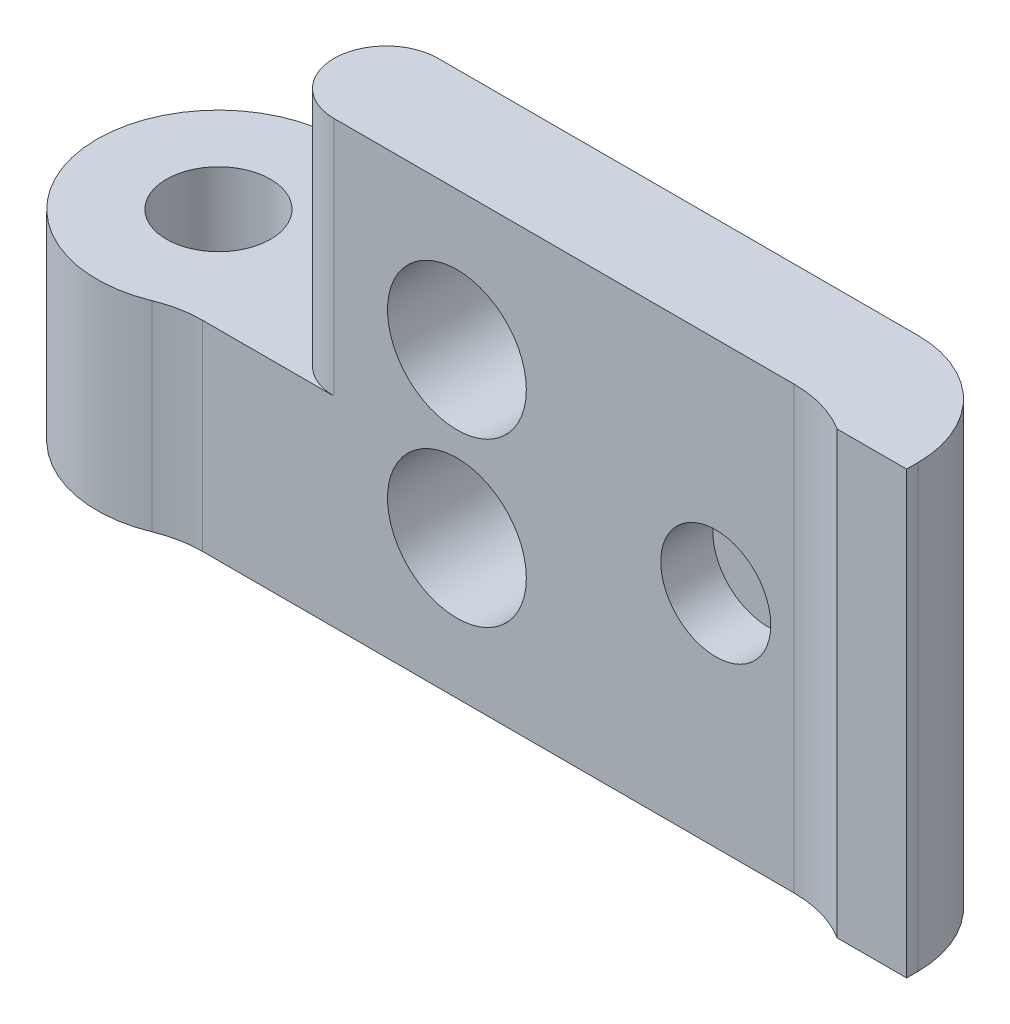
ISO-10303-21;
HEADER;
FILE_DESCRIPTION(('STEP AP214'),'2;1');
FILE_NAME('part.step','',(''),(''),'','','');
FILE_SCHEMA(('AUTOMOTIVE_DESIGN { 1 0 10303 214 1 1 1 1 }'));
ENDSEC;
DATA;
#1=APPLICATION_CONTEXT('core data for automotive mechanical design processes');
#2=APPLICATION_PROTOCOL_DEFINITION('international standard','automotive_design',2000,#1);
#3=PRODUCT_CONTEXT('',#1,'mechanical');
#4=PRODUCT('Part','Part','',(#3));
#5=PRODUCT_RELATED_PRODUCT_CATEGORY('part','',(#4));
#6=PRODUCT_DEFINITION_FORMATION('','',#4);
#7=PRODUCT_DEFINITION_CONTEXT('part definition',#1,'design');
#8=PRODUCT_DEFINITION('design','',#6,#7);
#9=PRODUCT_DEFINITION_SHAPE('','',#8);
#10=(LENGTH_UNIT() NAMED_UNIT(*) SI_UNIT(.MILLI.,.METRE.));
#11=(NAMED_UNIT(*) PLANE_ANGLE_UNIT() SI_UNIT($,.RADIAN.));
#12=(NAMED_UNIT(*) SI_UNIT($,.STERADIAN.) SOLID_ANGLE_UNIT());
#13=UNCERTAINTY_MEASURE_WITH_UNIT(LENGTH_MEASURE(1.E-05),#10,'distance_accuracy_value','');
#14=(GEOMETRIC_REPRESENTATION_CONTEXT(3) GLOBAL_UNCERTAINTY_ASSIGNED_CONTEXT((#13)) GLOBAL_UNIT_ASSIGNED_CONTEXT((#10,
#11,#12)) REPRESENTATION_CONTEXT('',''));
#15=CARTESIAN_POINT('',(0.,0.,0.));
#16=DIRECTION('',(0.,0.,1.));
#17=DIRECTION('',(1.,0.,0.));
#18=AXIS2_PLACEMENT_3D('',#15,#16,#17);
#19=CARTESIAN_POINT('',(0.,12.7,-10.));
#20=DIRECTION('',(0.,-1.,0.));
#21=DIRECTION('',(0.,0.,1.));
#22=AXIS2_PLACEMENT_3D('',#19,#20,#21);
#23=CYLINDRICAL_SURFACE('',#22,3.5);
#24=CARTESIAN_POINT('',(0.,5.77,-10.));
#25=DIRECTION('',(0.,1.,0.));
#26=DIRECTION('',(0.,0.,1.));
#27=AXIS2_PLACEMENT_3D('',#24,#25,#26);
#28=CIRCLE('',#27,3.5);
#29=CARTESIAN_POINT('',(3.07871091735214,5.77,-11.6647940074906));
#30=VERTEX_POINT('',#29);
#31=CARTESIAN_POINT('',(1.32908678635889,5.77,-6.76217228464419));
#32=VERTEX_POINT('',#31);
#33=EDGE_CURVE('E184',#30,#32,#28,.T.);
#34=ORIENTED_EDGE('',*,*,#33,.F.);
#35=DIRECTION('',(0.,-1.,0.));
#36=VECTOR('',#35,1.);
#37=CARTESIAN_POINT('',(3.07871091735214,12.7,-11.6647940074906));
#38=LINE('',#37,#36);
#39=CARTESIAN_POINT('',(3.07871091735214,0.,-11.6647940074906));
#40=VERTEX_POINT('',#39);
#41=EDGE_CURVE('E220',#30,#40,#38,.T.);
#42=ORIENTED_EDGE('',*,*,#41,.T.);
#43=CARTESIAN_POINT('',(0.,0.,-10.));
#44=DIRECTION('',(0.,-1.,0.));
#45=DIRECTION('',(0.,0.,-1.));
#46=AXIS2_PLACEMENT_3D('',#43,#44,#45);
#47=CIRCLE('',#46,3.5);
#48=CARTESIAN_POINT('',(1.32908678635889,0.,-6.76217228464419));
#49=VERTEX_POINT('',#48);
#50=EDGE_CURVE('E189',#49,#40,#47,.T.);
#51=ORIENTED_EDGE('',*,*,#50,.F.);
#52=DIRECTION('',(0.,-1.,0.));
#53=VECTOR('',#52,1.);
#54=CARTESIAN_POINT('',(1.32908678635889,12.7,-6.76217228464419));
#55=LINE('',#54,#53);
#56=EDGE_CURVE('E56',#49,#32,#55,.F.);
#57=ORIENTED_EDGE('',*,*,#56,.T.);
#58=EDGE_LOOP('',(#34,#42,#51,#57));
#59=FACE_BOUND('',#58,.T.);
#60=ADVANCED_FACE('F35',(#59),#23,.T.);
#61=CARTESIAN_POINT('',(0.,12.7,-10.));
#62=DIRECTION('',(0.,0.,1.));
#63=DIRECTION('',(-1.,0.,0.));
#64=AXIS2_PLACEMENT_3D('',#61,#62,#63);
#65=PLANE('',#64);
#66=CARTESIAN_POINT('',(9.87154153523587,4.,-10.));
#67=DIRECTION('',(0.,0.,1.));
#68=DIRECTION('',(1.,0.,0.));
#69=AXIS2_PLACEMENT_3D('',#66,#67,#68);
#70=CIRCLE('',#69,2.);
#71=CARTESIAN_POINT('',(11.8715415352359,4.,-10.));
#72=VERTEX_POINT('',#71);
#73=EDGE_CURVE('E158',#72,#72,#70,.T.);
#74=ORIENTED_EDGE('',*,*,#73,.T.);
#75=EDGE_LOOP('',(#74));
#76=FACE_BOUND('',#75,.T.);
#77=CARTESIAN_POINT('',(9.87154153523587,8.7,-10.));
#78=DIRECTION('',(0.,0.,1.));
#79=DIRECTION('',(1.,0.,0.));
#80=AXIS2_PLACEMENT_3D('',#77,#78,#79);
#81=CIRCLE('',#80,2.);
#82=CARTESIAN_POINT('',(11.8715415352359,8.7,-10.));
#83=VERTEX_POINT('',#82);
#84=EDGE_CURVE('E164',#83,#83,#81,.T.);
#85=ORIENTED_EDGE('',*,*,#84,.T.);
#86=EDGE_LOOP('',(#85));
#87=FACE_BOUND('',#86,.T.);
#88=DIRECTION('',(1.,0.,0.));
#89=VECTOR('',#88,1.);
#90=CARTESIAN_POINT('',(0.,12.7,-10.));
#91=LINE('',#90,#89);
#92=CARTESIAN_POINT('',(6.33021279348027,12.7,-10.));
#93=VERTEX_POINT('',#92);
#94=CARTESIAN_POINT('',(20.1552127934803,12.7,-10.));
#95=VERTEX_POINT('',#94);
#96=EDGE_CURVE('E190',#93,#95,#91,.T.);
#97=ORIENTED_EDGE('',*,*,#96,.T.);
#98=DIRECTION('',(0.,-1.,0.));
#99=VECTOR('',#98,1.);
#100=CARTESIAN_POINT('',(20.1552127934803,12.7,-10.));
#101=LINE('',#100,#99);
#102=CARTESIAN_POINT('',(20.1552127934803,0.,-10.));
#103=VERTEX_POINT('',#102);
#104=EDGE_CURVE('E210',#95,#103,#101,.T.);
#105=ORIENTED_EDGE('',*,*,#104,.T.);
#106=DIRECTION('',(1.,0.,0.));
#107=VECTOR('',#106,1.);
#108=CARTESIAN_POINT('',(0.,0.,-10.));
#109=LINE('',#108,#107);
#110=CARTESIAN_POINT('',(5.87154153523587,0.,-10.));
#111=VERTEX_POINT('',#110);
#112=EDGE_CURVE('E200',#111,#103,#109,.T.);
#113=ORIENTED_EDGE('',*,*,#112,.F.);
#114=DIRECTION('',(0.,1.,0.));
#115=VECTOR('',#114,1.);
#116=CARTESIAN_POINT('',(5.87154153523587,5.77,-10.));
#117=LINE('',#116,#115);
#118=CARTESIAN_POINT('',(5.87154153523587,5.77,-10.));
#119=VERTEX_POINT('',#118);
#120=EDGE_CURVE('E208',#111,#119,#117,.T.);
#121=ORIENTED_EDGE('',*,*,#120,.T.);
#122=DIRECTION('',(-1.,0.,0.));
#123=VECTOR('',#122,1.);
#124=CARTESIAN_POINT('',(0.,5.77,-10.));
#125=LINE('',#124,#123);
#126=CARTESIAN_POINT('',(6.33021279348027,5.77,-10.));
#127=VERTEX_POINT('',#126);
#128=EDGE_CURVE('E186',#127,#119,#125,.T.);
#129=ORIENTED_EDGE('',*,*,#128,.F.);
#130=DIRECTION('',(0.,1.,0.));
#131=VECTOR('',#130,1.);
#132=CARTESIAN_POINT('',(6.33021279348027,-12.0075208868195,-10.));
#133=LINE('',#132,#131);
#134=EDGE_CURVE('E181',#127,#93,#133,.T.);
#135=ORIENTED_EDGE('',*,*,#134,.T.);
#136=EDGE_LOOP('',(#97,#105,#113,#121,#129,#135));
#137=FACE_BOUND('',#136,.T.);
#138=ADVANCED_FACE('F245',(#76,#87,#137),#65,.F.);
#139=CARTESIAN_POINT('',(23.3302127934803,12.7,-10.));
#140=DIRECTION('',(-1.,0.,0.));
#141=DIRECTION('',(0.,0.,-1.));
#142=AXIS2_PLACEMENT_3D('',#139,#140,#141);
#143=PLANE('',#142);
#144=DIRECTION('',(0.,0.,1.));
#145=VECTOR('',#144,1.);
#146=CARTESIAN_POINT('',(23.3302127934803,0.,-10.));
#147=LINE('',#146,#145);
#148=CARTESIAN_POINT('',(23.3302127934803,0.,-6.825));
#149=VERTEX_POINT('',#148);
#150=CARTESIAN_POINT('',(23.3302127934803,0.,-6.5));
#151=VERTEX_POINT('',#150);
#152=EDGE_CURVE('E203',#149,#151,#147,.T.);
#153=ORIENTED_EDGE('',*,*,#152,.F.);
#154=DIRECTION('',(0.,-1.,0.));
#155=VECTOR('',#154,1.);
#156=CARTESIAN_POINT('',(23.3302127934803,12.7,-6.825));
#157=LINE('',#156,#155);
#158=CARTESIAN_POINT('',(23.3302127934803,12.7,-6.825));
#159=VERTEX_POINT('',#158);
#160=EDGE_CURVE('E215',#149,#159,#157,.F.);
#161=ORIENTED_EDGE('',*,*,#160,.T.);
#162=DIRECTION('',(0.,0.,1.));
#163=VECTOR('',#162,1.);
#164=CARTESIAN_POINT('',(23.3302127934803,12.7,-10.));
#165=LINE('',#164,#163);
#166=CARTESIAN_POINT('',(23.3302127934803,12.7,-6.5));
#167=VERTEX_POINT('',#166);
#168=EDGE_CURVE('E193',#159,#167,#165,.T.);
#169=ORIENTED_EDGE('',*,*,#168,.T.);
#170=DIRECTION('',(0.,1.,0.));
#171=VECTOR('',#170,1.);
#172=CARTESIAN_POINT('',(23.3302127934803,-3.77253374436471,-6.5));
#173=LINE('',#172,#171);
#174=EDGE_CURVE('E128',#151,#167,#173,.T.);
#175=ORIENTED_EDGE('',*,*,#174,.F.);
#176=EDGE_LOOP('',(#153,#161,#169,#175));
#177=FACE_BOUND('',#176,.T.);
#178=ADVANCED_FACE('F258',(#177),#143,.F.);
#179=CARTESIAN_POINT('',(0.,12.7,-7.));
#180=DIRECTION('',(0.,0.,-1.));
#181=DIRECTION('',(1.,0.,0.));
#182=AXIS2_PLACEMENT_3D('',#179,#180,#181);
#183=PLANE('',#182);
#184=CARTESIAN_POINT('',(17.3302127934803,6.35,-7.));
#185=DIRECTION('',(0.,0.,1.));
#186=DIRECTION('',(1.,0.,0.));
#187=AXIS2_PLACEMENT_3D('',#184,#185,#186);
#188=CIRCLE('',#187,1.585);
#189=CARTESIAN_POINT('',(18.9152127934803,6.35,-7.));
#190=VERTEX_POINT('',#189);
#191=EDGE_CURVE('E145',#190,#190,#188,.T.);
#192=ORIENTED_EDGE('',*,*,#191,.F.);
#193=EDGE_LOOP('',(#192));
#194=FACE_BOUND('',#193,.T.);
#195=CARTESIAN_POINT('',(9.87154153523587,4.,-7.));
#196=DIRECTION('',(0.,0.,1.));
#197=DIRECTION('',(1.,0.,0.));
#198=AXIS2_PLACEMENT_3D('',#195,#196,#197);
#199=CIRCLE('',#198,2.);
#200=CARTESIAN_POINT('',(11.8715415352359,4.,-7.));
#201=VERTEX_POINT('',#200);
#202=EDGE_CURVE('E155',#201,#201,#199,.T.);
#203=ORIENTED_EDGE('',*,*,#202,.F.);
#204=EDGE_LOOP('',(#203));
#205=FACE_BOUND('',#204,.T.);
#206=CARTESIAN_POINT('',(9.87154153523587,8.7,-7.));
#207=DIRECTION('',(0.,0.,1.));
#208=DIRECTION('',(1.,0.,0.));
#209=AXIS2_PLACEMENT_3D('',#206,#207,#208);
#210=CIRCLE('',#209,2.);
#211=CARTESIAN_POINT('',(11.8715415352359,8.7,-7.));
#212=VERTEX_POINT('',#211);
#213=EDGE_CURVE('E161',#212,#212,#210,.T.);
#214=ORIENTED_EDGE('',*,*,#213,.F.);
#215=EDGE_LOOP('',(#214));
#216=FACE_BOUND('',#215,.T.);
#217=DIRECTION('',(1.,0.,0.));
#218=VECTOR('',#217,1.);
#219=CARTESIAN_POINT('',(0.,5.77,-7.));
#220=LINE('',#219,#218);
#221=CARTESIAN_POINT('',(2.53475837112731,5.77,-7.));
#222=VERTEX_POINT('',#221);
#223=CARTESIAN_POINT('',(6.33021279348027,5.77,-7.));
#224=VERTEX_POINT('',#223);
#225=EDGE_CURVE('E197',#222,#224,#220,.T.);
#226=ORIENTED_EDGE('',*,*,#225,.F.);
#227=DIRECTION('',(0.,1.,0.));
#228=VECTOR('',#227,1.);
#229=CARTESIAN_POINT('',(2.53475837112731,0.,-7.));
#230=LINE('',#229,#228);
#231=CARTESIAN_POINT('',(2.53475837112731,0.,-7.));
#232=VERTEX_POINT('',#231);
#233=EDGE_CURVE('E223',#222,#232,#230,.F.);
#234=ORIENTED_EDGE('',*,*,#233,.T.);
#235=DIRECTION('',(-1.,0.,0.));
#236=VECTOR('',#235,1.);
#237=CARTESIAN_POINT('',(0.,0.,-7.));
#238=LINE('',#237,#236);
#239=CARTESIAN_POINT('',(19.5909600803877,0.,-7.));
#240=VERTEX_POINT('',#239);
#241=EDGE_CURVE('E194',#240,#232,#238,.T.);
#242=ORIENTED_EDGE('',*,*,#241,.F.);
#243=DIRECTION('',(0.,1.,0.));
#244=VECTOR('',#243,1.);
#245=CARTESIAN_POINT('',(19.5909600803877,-3.77253374436471,-7.));
#246=LINE('',#245,#244);
#247=CARTESIAN_POINT('',(19.5909600803877,12.7,-7.));
#248=VERTEX_POINT('',#247);
#249=EDGE_CURVE('E150',#240,#248,#246,.T.);
#250=ORIENTED_EDGE('',*,*,#249,.T.);
#251=DIRECTION('',(-1.,0.,0.));
#252=VECTOR('',#251,1.);
#253=CARTESIAN_POINT('',(0.,12.7,-7.));
#254=LINE('',#253,#252);
#255=CARTESIAN_POINT('',(6.33021279348027,12.7,-7.));
#256=VERTEX_POINT('',#255);
#257=EDGE_CURVE('E141',#248,#256,#254,.T.);
#258=ORIENTED_EDGE('',*,*,#257,.T.);
#259=DIRECTION('',(0.,1.,0.));
#260=VECTOR('',#259,1.);
#261=CARTESIAN_POINT('',(6.33021279348027,-12.0075208868195,-7.));
#262=LINE('',#261,#260);
#263=EDGE_CURVE('E178',#224,#256,#262,.T.);
#264=ORIENTED_EDGE('',*,*,#263,.F.);
#265=EDGE_LOOP('',(#226,#234,#242,#250,#258,#264));
#266=FACE_BOUND('',#265,.T.);
#267=ADVANCED_FACE('F236',(#194,#205,#216,#266),#183,.F.);
#268=CARTESIAN_POINT('',(0.,12.7,-10.));
#269=DIRECTION('',(0.,1.,0.));
#270=DIRECTION('',(0.,0.,-1.));
#271=AXIS2_PLACEMENT_3D('',#268,#269,#270);
#272=PLANE('',#271);
#273=ORIENTED_EDGE('',*,*,#168,.F.);
#274=CARTESIAN_POINT('',(20.1552127934803,12.7,-6.825));
#275=DIRECTION('',(0.,1.,0.));
#276=DIRECTION('',(0.,0.,1.));
#277=AXIS2_PLACEMENT_3D('',#274,#275,#276);
#278=CIRCLE('',#277,3.175);
#279=EDGE_CURVE('E217',#159,#95,#278,.T.);
#280=ORIENTED_EDGE('',*,*,#279,.T.);
#281=ORIENTED_EDGE('',*,*,#96,.F.);
#282=CARTESIAN_POINT('',(6.33021279348027,12.7,-8.5));
#283=DIRECTION('',(0.,-1.,0.));
#284=DIRECTION('',(0.,0.,-1.));
#285=AXIS2_PLACEMENT_3D('',#282,#283,#284);
#286=CIRCLE('',#285,1.5);
#287=EDGE_CURVE('E171',#93,#256,#286,.F.);
#288=ORIENTED_EDGE('',*,*,#287,.T.);
#289=ORIENTED_EDGE('',*,*,#257,.F.);
#290=CARTESIAN_POINT('',(19.5909600803877,12.7,-3.725));
#291=DIRECTION('',(0.,1.,0.));
#292=DIRECTION('',(0.,0.,1.));
#293=AXIS2_PLACEMENT_3D('',#290,#291,#292);
#294=CIRCLE('',#293,3.275);
#295=CARTESIAN_POINT('',(21.3302127934803,12.7,-6.5));
#296=VERTEX_POINT('',#295);
#297=EDGE_CURVE('E122',#296,#248,#294,.T.);
#298=ORIENTED_EDGE('',*,*,#297,.F.);
#299=DIRECTION('',(-1.,0.,0.));
#300=VECTOR('',#299,1.);
#301=CARTESIAN_POINT('',(0.,12.7,-6.5));
#302=LINE('',#301,#300);
#303=EDGE_CURVE('E129',#167,#296,#302,.T.);
#304=ORIENTED_EDGE('',*,*,#303,.F.);
#305=EDGE_LOOP('',(#273,#280,#281,#288,#289,#298,#304));
#306=FACE_BOUND('',#305,.T.);
#307=ADVANCED_FACE('F139',(#306),#272,.T.);
#308=CARTESIAN_POINT('',(0.,0.,-10.));
#309=DIRECTION('',(0.,1.,0.));
#310=DIRECTION('',(0.,0.,-1.));
#311=AXIS2_PLACEMENT_3D('',#308,#309,#310);
#312=PLANE('',#311);
#313=CARTESIAN_POINT('',(0.,0.,-10.));
#314=DIRECTION('',(0.,-1.,0.));
#315=DIRECTION('',(0.,0.,-1.));
#316=AXIS2_PLACEMENT_3D('',#313,#314,#315);
#317=CIRCLE('',#316,1.5);
#318=CARTESIAN_POINT('',(0.,0.,-11.5));
#319=VERTEX_POINT('',#318);
#320=EDGE_CURVE('E168',#319,#319,#317,.T.);
#321=ORIENTED_EDGE('',*,*,#320,.F.);
#322=EDGE_LOOP('',(#321));
#323=FACE_BOUND('',#322,.T.);
#324=ORIENTED_EDGE('',*,*,#112,.T.);
#325=CARTESIAN_POINT('',(20.1552127934803,0.,-6.825));
#326=DIRECTION('',(0.,1.,0.));
#327=DIRECTION('',(0.,0.,1.));
#328=AXIS2_PLACEMENT_3D('',#325,#326,#327);
#329=CIRCLE('',#328,3.175);
#330=EDGE_CURVE('E213',#103,#149,#329,.F.);
#331=ORIENTED_EDGE('',*,*,#330,.T.);
#332=ORIENTED_EDGE('',*,*,#152,.T.);
#333=DIRECTION('',(1.,0.,0.));
#334=VECTOR('',#333,1.);
#335=CARTESIAN_POINT('',(0.,0.,-6.5));
#336=LINE('',#335,#334);
#337=CARTESIAN_POINT('',(21.3302127934803,0.,-6.5));
#338=VERTEX_POINT('',#337);
#339=EDGE_CURVE('E152',#338,#151,#336,.T.);
#340=ORIENTED_EDGE('',*,*,#339,.F.);
#341=CARTESIAN_POINT('',(19.5909600803877,0.,-3.725));
#342=DIRECTION('',(0.,1.,0.));
#343=DIRECTION('',(0.,0.,1.));
#344=AXIS2_PLACEMENT_3D('',#341,#342,#343);
#345=CIRCLE('',#344,3.275);
#346=EDGE_CURVE('E125',#240,#338,#345,.F.);
#347=ORIENTED_EDGE('',*,*,#346,.F.);
#348=ORIENTED_EDGE('',*,*,#241,.T.);
#349=CARTESIAN_POINT('',(2.53475837112731,0.,-3.825));
#350=DIRECTION('',(0.,1.,0.));
#351=DIRECTION('',(0.,0.,1.));
#352=AXIS2_PLACEMENT_3D('',#349,#350,#351);
#353=CIRCLE('',#352,3.175);
#354=EDGE_CURVE('E43',#232,#49,#353,.T.);
#355=ORIENTED_EDGE('',*,*,#354,.T.);
#356=ORIENTED_EDGE('',*,*,#50,.T.);
#357=CARTESIAN_POINT('',(5.87154153523587,0.,-13.175));
#358=DIRECTION('',(0.,1.,0.));
#359=DIRECTION('',(0.,0.,1.));
#360=AXIS2_PLACEMENT_3D('',#357,#358,#359);
#361=CIRCLE('',#360,3.175);
#362=EDGE_CURVE('E226',#40,#111,#361,.T.);
#363=ORIENTED_EDGE('',*,*,#362,.T.);
#364=EDGE_LOOP('',(#324,#331,#332,#340,#347,#348,#355,#356,#363));
#365=FACE_BOUND('',#364,.T.);
#366=ADVANCED_FACE('F230',(#323,#365),#312,.F.);
#367=CARTESIAN_POINT('',(0.,5.77,0.));
#368=DIRECTION('',(0.,-1.,0.));
#369=DIRECTION('',(-0.707106781186547,0.,0.707106781186548));
#370=AXIS2_PLACEMENT_3D('',#367,#368,#369);
#371=PLANE('',#370);
#372=CARTESIAN_POINT('',(0.,5.77,-10.));
#373=DIRECTION('',(0.,-1.,0.));
#374=DIRECTION('',(0.,0.,-1.));
#375=AXIS2_PLACEMENT_3D('',#372,#373,#374);
#376=CIRCLE('',#375,1.5);
#377=CARTESIAN_POINT('',(0.,5.77,-11.5));
#378=VERTEX_POINT('',#377);
#379=EDGE_CURVE('E167',#378,#378,#376,.T.);
#380=ORIENTED_EDGE('',*,*,#379,.T.);
#381=EDGE_LOOP('',(#380));
#382=FACE_BOUND('',#381,.T.);
#383=CARTESIAN_POINT('',(6.33021279348027,5.77,-8.5));
#384=DIRECTION('',(0.,1.,0.));
#385=DIRECTION('',(0.,0.,1.));
#386=AXIS2_PLACEMENT_3D('',#383,#384,#385);
#387=CIRCLE('',#386,1.5);
#388=EDGE_CURVE('E175',#127,#224,#387,.T.);
#389=ORIENTED_EDGE('',*,*,#388,.F.);
#390=ORIENTED_EDGE('',*,*,#128,.T.);
#391=CARTESIAN_POINT('',(5.87154153523587,5.77,-13.175));
#392=DIRECTION('',(0.,-1.,0.));
#393=DIRECTION('',(0.,0.,-1.));
#394=AXIS2_PLACEMENT_3D('',#391,#392,#393);
#395=CIRCLE('',#394,3.175);
#396=EDGE_CURVE('E228',#119,#30,#395,.T.);
#397=ORIENTED_EDGE('',*,*,#396,.T.);
#398=ORIENTED_EDGE('',*,*,#33,.T.);
#399=CARTESIAN_POINT('',(2.53475837112731,5.77,-3.825));
#400=DIRECTION('',(0.,-1.,0.));
#401=DIRECTION('',(0.,0.,-1.));
#402=AXIS2_PLACEMENT_3D('',#399,#400,#401);
#403=CIRCLE('',#402,3.175);
#404=EDGE_CURVE('E11',#32,#222,#403,.T.);
#405=ORIENTED_EDGE('',*,*,#404,.T.);
#406=ORIENTED_EDGE('',*,*,#225,.T.);
#407=EDGE_LOOP('',(#389,#390,#397,#398,#405,#406));
#408=FACE_BOUND('',#407,.T.);
#409=ADVANCED_FACE('F238',(#382,#408),#371,.F.);
#410=CARTESIAN_POINT('',(6.33021279348027,-12.0075208868195,-8.5));
#411=DIRECTION('',(0.,1.,0.));
#412=DIRECTION('',(0.,0.,-1.));
#413=AXIS2_PLACEMENT_3D('',#410,#411,#412);
#414=CYLINDRICAL_SURFACE('',#413,1.5);
#415=ORIENTED_EDGE('',*,*,#134,.F.);
#416=ORIENTED_EDGE('',*,*,#388,.T.);
#417=ORIENTED_EDGE('',*,*,#263,.T.);
#418=ORIENTED_EDGE('',*,*,#287,.F.);
#419=EDGE_LOOP('',(#415,#416,#417,#418));
#420=FACE_BOUND('',#419,.T.);
#421=ADVANCED_FACE('F242',(#420),#414,.T.);
#422=CARTESIAN_POINT('',(0.,0.,-10.));
#423=DIRECTION('',(0.,1.,0.));
#424=DIRECTION('',(0.,0.,-1.));
#425=AXIS2_PLACEMENT_3D('',#422,#423,#424);
#426=CYLINDRICAL_SURFACE('',#425,1.5);
#427=ORIENTED_EDGE('',*,*,#320,.T.);
#428=EDGE_LOOP('',(#427));
#429=FACE_BOUND('',#428,.T.);
#430=ORIENTED_EDGE('',*,*,#379,.F.);
#431=EDGE_LOOP('',(#430));
#432=FACE_BOUND('',#431,.T.);
#433=ADVANCED_FACE('F305',(#429,#432),#426,.F.);
#434=CARTESIAN_POINT('',(9.87154153523587,8.7,-17.));
#435=DIRECTION('',(0.,0.,1.));
#436=DIRECTION('',(1.,0.,0.));
#437=AXIS2_PLACEMENT_3D('',#434,#435,#436);
#438=CYLINDRICAL_SURFACE('',#437,2.);
#439=ORIENTED_EDGE('',*,*,#213,.T.);
#440=EDGE_LOOP('',(#439));
#441=FACE_BOUND('',#440,.T.);
#442=ORIENTED_EDGE('',*,*,#84,.F.);
#443=EDGE_LOOP('',(#442));
#444=FACE_BOUND('',#443,.T.);
#445=ADVANCED_FACE('F301',(#441,#444),#438,.F.);
#446=CARTESIAN_POINT('',(9.87154153523587,4.,-17.));
#447=DIRECTION('',(0.,0.,1.));
#448=DIRECTION('',(1.,0.,0.));
#449=AXIS2_PLACEMENT_3D('',#446,#447,#448);
#450=CYLINDRICAL_SURFACE('',#449,2.);
#451=ORIENTED_EDGE('',*,*,#202,.T.);
#452=EDGE_LOOP('',(#451));
#453=FACE_BOUND('',#452,.T.);
#454=ORIENTED_EDGE('',*,*,#73,.F.);
#455=EDGE_LOOP('',(#454));
#456=FACE_BOUND('',#455,.T.);
#457=ADVANCED_FACE('F296',(#453,#456),#450,.F.);
#458=CARTESIAN_POINT('',(0.,-3.77253374436471,-6.5));
#459=DIRECTION('',(0.,0.,-1.));
#460=DIRECTION('',(-1.,0.,0.));
#461=AXIS2_PLACEMENT_3D('',#458,#459,#460);
#462=PLANE('',#461);
#463=DIRECTION('',(0.,1.,0.));
#464=VECTOR('',#463,1.);
#465=CARTESIAN_POINT('',(21.3302127934803,-3.77253374436471,-6.5));
#466=LINE('',#465,#464);
#467=EDGE_CURVE('E118',#338,#296,#466,.T.);
#468=ORIENTED_EDGE('',*,*,#467,.F.);
#469=ORIENTED_EDGE('',*,*,#339,.T.);
#470=ORIENTED_EDGE('',*,*,#174,.T.);
#471=ORIENTED_EDGE('',*,*,#303,.T.);
#472=EDGE_LOOP('',(#468,#469,#470,#471));
#473=FACE_BOUND('',#472,.T.);
#474=ADVANCED_FACE('F133',(#473),#462,.F.);
#475=CARTESIAN_POINT('',(19.5909600803877,-3.77253374436471,-3.725));
#476=DIRECTION('',(0.,1.,0.));
#477=DIRECTION('',(0.,0.,1.));
#478=AXIS2_PLACEMENT_3D('',#475,#476,#477);
#479=CYLINDRICAL_SURFACE('',#478,3.275);
#480=ORIENTED_EDGE('',*,*,#249,.F.);
#481=ORIENTED_EDGE('',*,*,#346,.T.);
#482=ORIENTED_EDGE('',*,*,#467,.T.);
#483=ORIENTED_EDGE('',*,*,#297,.T.);
#484=EDGE_LOOP('',(#480,#481,#482,#483));
#485=FACE_BOUND('',#484,.T.);
#486=ADVANCED_FACE('F120',(#485),#479,.F.);
#487=CARTESIAN_POINT('',(20.1552127934803,12.7,-6.825));
#488=DIRECTION('',(0.,-1.,0.));
#489=DIRECTION('',(0.,0.,-1.));
#490=AXIS2_PLACEMENT_3D('',#487,#488,#489);
#491=CYLINDRICAL_SURFACE('',#490,3.175);
#492=ORIENTED_EDGE('',*,*,#279,.F.);
#493=ORIENTED_EDGE('',*,*,#160,.F.);
#494=ORIENTED_EDGE('',*,*,#330,.F.);
#495=ORIENTED_EDGE('',*,*,#104,.F.);
#496=EDGE_LOOP('',(#492,#493,#494,#495));
#497=FACE_BOUND('',#496,.T.);
#498=ADVANCED_FACE('F254',(#497),#491,.T.);
#499=CARTESIAN_POINT('',(5.87154153523587,12.7,-13.175));
#500=DIRECTION('',(0.,-1.,0.));
#501=DIRECTION('',(0.,0.,-1.));
#502=AXIS2_PLACEMENT_3D('',#499,#500,#501);
#503=CYLINDRICAL_SURFACE('',#502,3.175);
#504=ORIENTED_EDGE('',*,*,#396,.F.);
#505=ORIENTED_EDGE('',*,*,#120,.F.);
#506=ORIENTED_EDGE('',*,*,#362,.F.);
#507=ORIENTED_EDGE('',*,*,#41,.F.);
#508=EDGE_LOOP('',(#504,#505,#506,#507));
#509=FACE_BOUND('',#508,.T.);
#510=ADVANCED_FACE('F251',(#509),#503,.F.);
#511=CARTESIAN_POINT('',(2.53475837112731,12.7,-3.825));
#512=DIRECTION('',(0.,-1.,0.));
#513=DIRECTION('',(0.,0.,-1.));
#514=AXIS2_PLACEMENT_3D('',#511,#512,#513);
#515=CYLINDRICAL_SURFACE('',#514,3.175);
#516=ORIENTED_EDGE('',*,*,#404,.F.);
#517=ORIENTED_EDGE('',*,*,#56,.F.);
#518=ORIENTED_EDGE('',*,*,#354,.F.);
#519=ORIENTED_EDGE('',*,*,#233,.F.);
#520=EDGE_LOOP('',(#516,#517,#518,#519));
#521=FACE_BOUND('',#520,.T.);
#522=ADVANCED_FACE('F37',(#521),#515,.F.);
#523=CARTESIAN_POINT('',(17.3302127934803,6.35,-8.5));
#524=DIRECTION('',(0.,0.,1.));
#525=DIRECTION('',(1.,0.,0.));
#526=AXIS2_PLACEMENT_3D('',#523,#524,#525);
#527=CYLINDRICAL_SURFACE('',#526,1.585);
#528=CARTESIAN_POINT('',(17.3302127934803,6.35,-8.5));
#529=DIRECTION('',(0.,0.,1.));
#530=DIRECTION('',(1.,0.,0.));
#531=AXIS2_PLACEMENT_3D('',#528,#529,#530);
#532=CIRCLE('',#531,1.585);
#533=CARTESIAN_POINT('',(18.9152127934803,6.35,-8.5));
#534=VERTEX_POINT('',#533);
#535=EDGE_CURVE('E142',#534,#534,#532,.T.);
#536=ORIENTED_EDGE('',*,*,#535,.F.);
#537=EDGE_LOOP('',(#536));
#538=FACE_BOUND('',#537,.T.);
#539=ORIENTED_EDGE('',*,*,#191,.T.);
#540=EDGE_LOOP('',(#539));
#541=FACE_BOUND('',#540,.T.);
#542=ADVANCED_FACE('F279',(#538,#541),#527,.F.);
#543=CARTESIAN_POINT('',(17.3302127934803,6.35,-8.5));
#544=DIRECTION('',(0.,0.,1.));
#545=DIRECTION('',(1.,0.,0.));
#546=AXIS2_PLACEMENT_3D('',#543,#544,#545);
#547=PLANE('',#546);
#548=ORIENTED_EDGE('',*,*,#535,.T.);
#549=EDGE_LOOP('',(#548));
#550=FACE_BOUND('',#549,.T.);
#551=ADVANCED_FACE('F283',(#550),#547,.T.);
#552=CLOSED_SHELL('',(#60,#138,#178,#267,#307,#366,#409,#421,#433,#445,#457,#474,#486,#498,#510,
#522,#542,#551));
#553=MANIFOLD_SOLID_BREP('B2',#552);
#554=ADVANCED_BREP_SHAPE_REPRESENTATION('',(#18,#553),#14);
#555=SHAPE_DEFINITION_REPRESENTATION(#9,#554);
ENDSEC;
END-ISO-10303-21;
